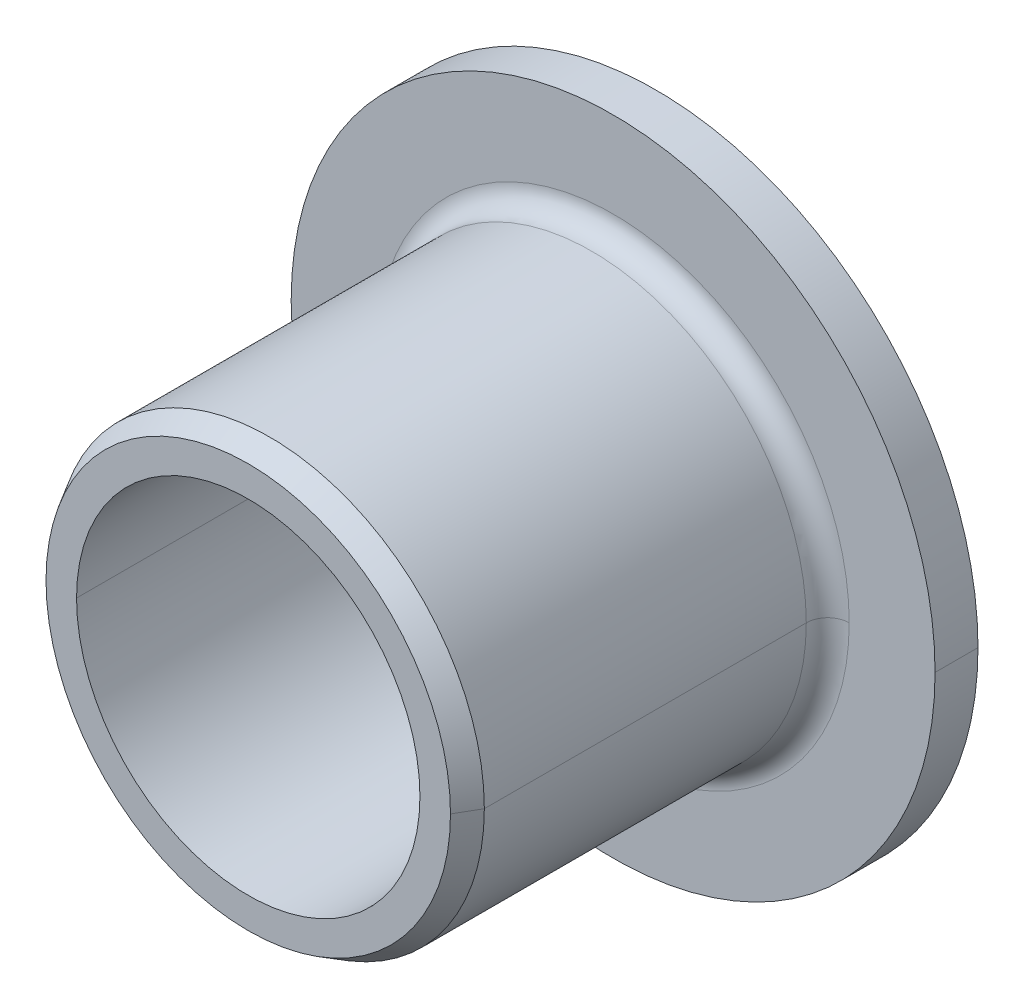
ISO-10303-21;
HEADER;
FILE_DESCRIPTION(('STEP AP214'),'2;1');
FILE_NAME('part.step','',(''),(''),'','','');
FILE_SCHEMA(('AUTOMOTIVE_DESIGN { 1 0 10303 214 1 1 1 1 }'));
ENDSEC;
DATA;
#1=APPLICATION_CONTEXT('core data for automotive mechanical design processes');
#2=APPLICATION_PROTOCOL_DEFINITION('international standard','automotive_design',2000,#1);
#3=PRODUCT_CONTEXT('',#1,'mechanical');
#4=PRODUCT('Part','Part','',(#3));
#5=PRODUCT_RELATED_PRODUCT_CATEGORY('part','',(#4));
#6=PRODUCT_DEFINITION_FORMATION('','',#4);
#7=PRODUCT_DEFINITION_CONTEXT('part definition',#1,'design');
#8=PRODUCT_DEFINITION('design','',#6,#7);
#9=PRODUCT_DEFINITION_SHAPE('','',#8);
#10=(LENGTH_UNIT() NAMED_UNIT(*) SI_UNIT(.MILLI.,.METRE.));
#11=(NAMED_UNIT(*) PLANE_ANGLE_UNIT() SI_UNIT($,.RADIAN.));
#12=(NAMED_UNIT(*) SI_UNIT($,.STERADIAN.) SOLID_ANGLE_UNIT());
#13=UNCERTAINTY_MEASURE_WITH_UNIT(LENGTH_MEASURE(1.E-05),#10,'distance_accuracy_value','');
#14=(GEOMETRIC_REPRESENTATION_CONTEXT(3) GLOBAL_UNCERTAINTY_ASSIGNED_CONTEXT((#13)) GLOBAL_UNIT_ASSIGNED_CONTEXT((#10,
#11,#12)) REPRESENTATION_CONTEXT('',''));
#15=CARTESIAN_POINT('',(0.,0.,0.));
#16=DIRECTION('',(0.,0.,1.));
#17=DIRECTION('',(1.,0.,0.));
#18=AXIS2_PLACEMENT_3D('',#15,#16,#17);
#19=CARTESIAN_POINT('',(5.75,0.,0.));
#20=DIRECTION('',(0.,0.,-1.));
#21=DIRECTION('',(0.,-1.,0.));
#22=AXIS2_PLACEMENT_3D('',#19,#20,#21);
#23=PLANE('',#22);
#24=CARTESIAN_POINT('',(0.,0.,0.));
#25=DIRECTION('',(0.,0.,1.));
#26=DIRECTION('',(1.,0.,0.));
#27=AXIS2_PLACEMENT_3D('',#24,#25,#26);
#28=CIRCLE('',#27,4.);
#29=CARTESIAN_POINT('',(4.,0.,0.));
#30=VERTEX_POINT('',#29);
#31=CARTESIAN_POINT('',(-4.,0.,0.));
#32=VERTEX_POINT('',#31);
#33=EDGE_CURVE('E11',#30,#32,#28,.T.);
#34=ORIENTED_EDGE('',*,*,#33,.T.);
#35=CARTESIAN_POINT('',(0.,0.,0.));
#36=DIRECTION('',(0.,0.,1.));
#37=DIRECTION('',(1.,0.,0.));
#38=AXIS2_PLACEMENT_3D('',#35,#36,#37);
#39=CIRCLE('',#38,4.);
#40=EDGE_CURVE('E145',#32,#30,#39,.T.);
#41=ORIENTED_EDGE('',*,*,#40,.T.);
#42=EDGE_LOOP('',(#34,#41));
#43=FACE_BOUND('',#42,.T.);
#44=CARTESIAN_POINT('',(0.,0.,0.));
#45=DIRECTION('',(0.,0.,1.));
#46=DIRECTION('',(1.,0.,0.));
#47=AXIS2_PLACEMENT_3D('',#44,#45,#46);
#48=CIRCLE('',#47,7.5);
#49=CARTESIAN_POINT('',(7.5,0.,0.));
#50=VERTEX_POINT('',#49);
#51=CARTESIAN_POINT('',(-7.5,0.,0.));
#52=VERTEX_POINT('',#51);
#53=EDGE_CURVE('E153',#50,#52,#48,.T.);
#54=ORIENTED_EDGE('',*,*,#53,.F.);
#55=CARTESIAN_POINT('',(0.,0.,0.));
#56=DIRECTION('',(0.,0.,1.));
#57=DIRECTION('',(1.,0.,0.));
#58=AXIS2_PLACEMENT_3D('',#55,#56,#57);
#59=CIRCLE('',#58,7.5);
#60=EDGE_CURVE('E110',#52,#50,#59,.T.);
#61=ORIENTED_EDGE('',*,*,#60,.F.);
#62=EDGE_LOOP('',(#54,#61));
#63=FACE_BOUND('',#62,.T.);
#64=ADVANCED_FACE('F16',(#43,#63),#23,.T.);
#65=CARTESIAN_POINT('',(0.,0.,4.75));
#66=DIRECTION('',(0.,0.,1.));
#67=DIRECTION('',(1.,0.,0.));
#68=AXIS2_PLACEMENT_3D('',#65,#66,#67);
#69=CYLINDRICAL_SURFACE('',#68,4.);
#70=DIRECTION('',(0.,0.,1.));
#71=VECTOR('',#70,1.);
#72=CARTESIAN_POINT('',(4.,0.,4.75));
#73=LINE('',#72,#71);
#74=CARTESIAN_POINT('',(4.,0.,9.5));
#75=VERTEX_POINT('',#74);
#76=EDGE_CURVE('E150',#30,#75,#73,.T.);
#77=ORIENTED_EDGE('',*,*,#76,.T.);
#78=CARTESIAN_POINT('',(0.,0.,9.5));
#79=DIRECTION('',(0.,0.,1.));
#80=DIRECTION('',(1.,0.,0.));
#81=AXIS2_PLACEMENT_3D('',#78,#79,#80);
#82=CIRCLE('',#81,4.);
#83=CARTESIAN_POINT('',(-4.,0.,9.5));
#84=VERTEX_POINT('',#83);
#85=EDGE_CURVE('E27',#75,#84,#82,.T.);
#86=ORIENTED_EDGE('',*,*,#85,.T.);
#87=DIRECTION('',(0.,0.,-1.));
#88=VECTOR('',#87,1.);
#89=CARTESIAN_POINT('',(-4.,0.,4.75));
#90=LINE('',#89,#88);
#91=EDGE_CURVE('E149',#84,#32,#90,.T.);
#92=ORIENTED_EDGE('',*,*,#91,.T.);
#93=ORIENTED_EDGE('',*,*,#33,.F.);
#94=EDGE_LOOP('',(#77,#86,#92,#93));
#95=FACE_BOUND('',#94,.T.);
#96=ADVANCED_FACE('F210',(#95),#69,.F.);
#97=CARTESIAN_POINT('',(4.3556624327,0.,9.5));
#98=DIRECTION('',(0.,0.,1.));
#99=DIRECTION('',(1.,0.,0.));
#100=AXIS2_PLACEMENT_3D('',#97,#98,#99);
#101=PLANE('',#100);
#102=ORIENTED_EDGE('',*,*,#85,.F.);
#103=CARTESIAN_POINT('',(0.,0.,9.5));
#104=DIRECTION('',(0.,0.,1.));
#105=DIRECTION('',(1.,0.,0.));
#106=AXIS2_PLACEMENT_3D('',#103,#104,#105);
#107=CIRCLE('',#106,4.);
#108=EDGE_CURVE('E159',#84,#75,#107,.T.);
#109=ORIENTED_EDGE('',*,*,#108,.F.);
#110=EDGE_LOOP('',(#102,#109));
#111=FACE_BOUND('',#110,.T.);
#112=CARTESIAN_POINT('',(0.,0.,9.5));
#113=DIRECTION('',(0.,0.,1.));
#114=DIRECTION('',(1.,0.,0.));
#115=AXIS2_PLACEMENT_3D('',#112,#113,#114);
#116=CIRCLE('',#115,4.7113248654);
#117=CARTESIAN_POINT('',(4.7113248654,0.,9.5));
#118=VERTEX_POINT('',#117);
#119=CARTESIAN_POINT('',(-4.7113248654,0.,9.5));
#120=VERTEX_POINT('',#119);
#121=EDGE_CURVE('E158',#118,#120,#116,.T.);
#122=ORIENTED_EDGE('',*,*,#121,.T.);
#123=CARTESIAN_POINT('',(0.,0.,9.5));
#124=DIRECTION('',(0.,0.,1.));
#125=DIRECTION('',(1.,0.,0.));
#126=AXIS2_PLACEMENT_3D('',#123,#124,#125);
#127=CIRCLE('',#126,4.7113248654);
#128=EDGE_CURVE('E141',#120,#118,#127,.T.);
#129=ORIENTED_EDGE('',*,*,#128,.T.);
#130=EDGE_LOOP('',(#122,#129));
#131=FACE_BOUND('',#130,.T.);
#132=ADVANCED_FACE('F18',(#111,#131),#101,.T.);
#133=CARTESIAN_POINT('',(0.,0.,9.25));
#134=DIRECTION('',(0.,0.,-1.));
#135=DIRECTION('',(1.,0.,0.));
#136=AXIS2_PLACEMENT_3D('',#133,#134,#135);
#137=CONICAL_SURFACE('',#136,4.8556624327,0.52359877560608);
#138=DIRECTION('',(-0.500000000006738,0.,0.866025403780548));
#139=VECTOR('',#138,1.);
#140=CARTESIAN_POINT('',(4.8556624327,0.,9.25));
#141=LINE('',#140,#139);
#142=CARTESIAN_POINT('',(5.,0.,9.));
#143=VERTEX_POINT('',#142);
#144=EDGE_CURVE('E163',#143,#118,#141,.T.);
#145=ORIENTED_EDGE('',*,*,#144,.T.);
#146=ORIENTED_EDGE('',*,*,#128,.F.);
#147=DIRECTION('',(-0.500000000006738,0.,-0.866025403780548));
#148=VECTOR('',#147,1.);
#149=CARTESIAN_POINT('',(-4.8556624327,0.,9.25));
#150=LINE('',#149,#148);
#151=CARTESIAN_POINT('',(-5.,0.,9.));
#152=VERTEX_POINT('',#151);
#153=EDGE_CURVE('E154',#120,#152,#150,.T.);
#154=ORIENTED_EDGE('',*,*,#153,.T.);
#155=CARTESIAN_POINT('',(0.,0.,9.));
#156=DIRECTION('',(0.,0.,1.));
#157=DIRECTION('',(1.,0.,0.));
#158=AXIS2_PLACEMENT_3D('',#155,#156,#157);
#159=CIRCLE('',#158,5.);
#160=EDGE_CURVE('E109',#152,#143,#159,.T.);
#161=ORIENTED_EDGE('',*,*,#160,.T.);
#162=EDGE_LOOP('',(#145,#146,#154,#161));
#163=FACE_BOUND('',#162,.T.);
#164=ADVANCED_FACE('F199',(#163),#137,.T.);
#165=CARTESIAN_POINT('',(0.,0.,5.25));
#166=DIRECTION('',(0.,0.,1.));
#167=DIRECTION('',(1.,0.,0.));
#168=AXIS2_PLACEMENT_3D('',#165,#166,#167);
#169=CYLINDRICAL_SURFACE('',#168,5.);
#170=DIRECTION('',(0.,0.,1.));
#171=VECTOR('',#170,1.);
#172=CARTESIAN_POINT('',(5.,0.,5.25));
#173=LINE('',#172,#171);
#174=CARTESIAN_POINT('',(5.,0.,1.5));
#175=VERTEX_POINT('',#174);
#176=EDGE_CURVE('E169',#175,#143,#173,.T.);
#177=ORIENTED_EDGE('',*,*,#176,.T.);
#178=ORIENTED_EDGE('',*,*,#160,.F.);
#179=DIRECTION('',(0.,0.,-1.));
#180=VECTOR('',#179,1.);
#181=CARTESIAN_POINT('',(-5.,0.,5.25));
#182=LINE('',#181,#180);
#183=CARTESIAN_POINT('',(-5.,0.,1.5));
#184=VERTEX_POINT('',#183);
#185=EDGE_CURVE('E121',#152,#184,#182,.T.);
#186=ORIENTED_EDGE('',*,*,#185,.T.);
#187=CARTESIAN_POINT('',(0.,0.,1.5));
#188=DIRECTION('',(0.,0.,1.));
#189=DIRECTION('',(1.,0.,0.));
#190=AXIS2_PLACEMENT_3D('',#187,#188,#189);
#191=CIRCLE('',#190,5.);
#192=EDGE_CURVE('E119',#184,#175,#191,.T.);
#193=ORIENTED_EDGE('',*,*,#192,.T.);
#194=EDGE_LOOP('',(#177,#178,#186,#193));
#195=FACE_BOUND('',#194,.T.);
#196=ADVANCED_FACE('F203',(#195),#169,.T.);
#197=CARTESIAN_POINT('',(0.,0.,1.5));
#198=DIRECTION('',(0.,0.,1.));
#199=DIRECTION('',(1.,0.,0.));
#200=AXIS2_PLACEMENT_3D('',#197,#198,#199);
#201=TOROIDAL_SURFACE('',#200,5.5,0.5);
#202=CARTESIAN_POINT('',(-5.5,0.,1.5));
#203=DIRECTION('',(0.,-1.,0.));
#204=DIRECTION('',(-1.,0.,0.));
#205=AXIS2_PLACEMENT_3D('',#202,#203,#204);
#206=CIRCLE('',#205,0.5);
#207=CARTESIAN_POINT('',(-5.5,0.,1.));
#208=VERTEX_POINT('',#207);
#209=EDGE_CURVE('E102',#208,#184,#206,.T.);
#210=ORIENTED_EDGE('',*,*,#209,.T.);
#211=CARTESIAN_POINT('',(0.,0.,1.5));
#212=DIRECTION('',(0.,0.,1.));
#213=DIRECTION('',(1.,0.,0.));
#214=AXIS2_PLACEMENT_3D('',#211,#212,#213);
#215=CIRCLE('',#214,5.);
#216=EDGE_CURVE('E127',#175,#184,#215,.T.);
#217=ORIENTED_EDGE('',*,*,#216,.F.);
#218=CARTESIAN_POINT('',(5.5,0.,1.5));
#219=DIRECTION('',(0.,-1.,0.));
#220=DIRECTION('',(1.,0.,0.));
#221=AXIS2_PLACEMENT_3D('',#218,#219,#220);
#222=CIRCLE('',#221,0.5);
#223=CARTESIAN_POINT('',(5.5,0.,1.));
#224=VERTEX_POINT('',#223);
#225=EDGE_CURVE('E105',#175,#224,#222,.T.);
#226=ORIENTED_EDGE('',*,*,#225,.T.);
#227=CARTESIAN_POINT('',(0.,0.,1.));
#228=DIRECTION('',(0.,0.,1.));
#229=DIRECTION('',(1.,0.,0.));
#230=AXIS2_PLACEMENT_3D('',#227,#228,#229);
#231=CIRCLE('',#230,5.5);
#232=EDGE_CURVE('E97',#224,#208,#231,.T.);
#233=ORIENTED_EDGE('',*,*,#232,.T.);
#234=EDGE_LOOP('',(#210,#217,#226,#233));
#235=FACE_BOUND('',#234,.T.);
#236=ADVANCED_FACE('F99',(#235),#201,.F.);
#237=CARTESIAN_POINT('',(6.5,0.,1.));
#238=DIRECTION('',(0.,0.,1.));
#239=DIRECTION('',(1.,0.,0.));
#240=AXIS2_PLACEMENT_3D('',#237,#238,#239);
#241=PLANE('',#240);
#242=ORIENTED_EDGE('',*,*,#232,.F.);
#243=CARTESIAN_POINT('',(0.,0.,1.));
#244=DIRECTION('',(0.,0.,1.));
#245=DIRECTION('',(1.,0.,0.));
#246=AXIS2_PLACEMENT_3D('',#243,#244,#245);
#247=CIRCLE('',#246,5.5);
#248=EDGE_CURVE('E112',#208,#224,#247,.T.);
#249=ORIENTED_EDGE('',*,*,#248,.F.);
#250=EDGE_LOOP('',(#242,#249));
#251=FACE_BOUND('',#250,.T.);
#252=CARTESIAN_POINT('',(0.,0.,1.));
#253=DIRECTION('',(0.,0.,1.));
#254=DIRECTION('',(1.,0.,0.));
#255=AXIS2_PLACEMENT_3D('',#252,#253,#254);
#256=CIRCLE('',#255,7.5);
#257=CARTESIAN_POINT('',(7.5,0.,1.));
#258=VERTEX_POINT('',#257);
#259=CARTESIAN_POINT('',(-7.5,0.,1.));
#260=VERTEX_POINT('',#259);
#261=EDGE_CURVE('E134',#258,#260,#256,.T.);
#262=ORIENTED_EDGE('',*,*,#261,.T.);
#263=CARTESIAN_POINT('',(0.,0.,1.));
#264=DIRECTION('',(0.,0.,1.));
#265=DIRECTION('',(1.,0.,0.));
#266=AXIS2_PLACEMENT_3D('',#263,#264,#265);
#267=CIRCLE('',#266,7.5);
#268=EDGE_CURVE('E39',#260,#258,#267,.T.);
#269=ORIENTED_EDGE('',*,*,#268,.T.);
#270=EDGE_LOOP('',(#262,#269));
#271=FACE_BOUND('',#270,.T.);
#272=ADVANCED_FACE('F113',(#251,#271),#241,.T.);
#273=CARTESIAN_POINT('',(0.,0.,0.5));
#274=DIRECTION('',(0.,0.,1.));
#275=DIRECTION('',(1.,0.,0.));
#276=AXIS2_PLACEMENT_3D('',#273,#274,#275);
#277=CYLINDRICAL_SURFACE('',#276,7.5);
#278=DIRECTION('',(0.,0.,1.));
#279=VECTOR('',#278,1.);
#280=CARTESIAN_POINT('',(7.5,0.,0.5));
#281=LINE('',#280,#279);
#282=EDGE_CURVE('E144',#50,#258,#281,.T.);
#283=ORIENTED_EDGE('',*,*,#282,.T.);
#284=ORIENTED_EDGE('',*,*,#268,.F.);
#285=DIRECTION('',(0.,0.,-1.));
#286=VECTOR('',#285,1.);
#287=CARTESIAN_POINT('',(-7.5,0.,0.5));
#288=LINE('',#287,#286);
#289=EDGE_CURVE('E20',#260,#52,#288,.T.);
#290=ORIENTED_EDGE('',*,*,#289,.T.);
#291=ORIENTED_EDGE('',*,*,#60,.T.);
#292=EDGE_LOOP('',(#283,#284,#290,#291));
#293=FACE_BOUND('',#292,.T.);
#294=ADVANCED_FACE('F230',(#293),#277,.T.);
#295=CARTESIAN_POINT('',(0.,0.,0.5));
#296=DIRECTION('',(0.,0.,1.));
#297=DIRECTION('',(1.,0.,0.));
#298=AXIS2_PLACEMENT_3D('',#295,#296,#297);
#299=CYLINDRICAL_SURFACE('',#298,7.5);
#300=ORIENTED_EDGE('',*,*,#282,.F.);
#301=ORIENTED_EDGE('',*,*,#53,.T.);
#302=ORIENTED_EDGE('',*,*,#289,.F.);
#303=ORIENTED_EDGE('',*,*,#261,.F.);
#304=EDGE_LOOP('',(#300,#301,#302,#303));
#305=FACE_BOUND('',#304,.T.);
#306=ADVANCED_FACE('F232',(#305),#299,.T.);
#307=CARTESIAN_POINT('',(0.,0.,1.5));
#308=DIRECTION('',(0.,0.,1.));
#309=DIRECTION('',(1.,0.,0.));
#310=AXIS2_PLACEMENT_3D('',#307,#308,#309);
#311=TOROIDAL_SURFACE('',#310,5.5,0.5);
#312=ORIENTED_EDGE('',*,*,#209,.F.);
#313=ORIENTED_EDGE('',*,*,#248,.T.);
#314=ORIENTED_EDGE('',*,*,#225,.F.);
#315=ORIENTED_EDGE('',*,*,#192,.F.);
#316=EDGE_LOOP('',(#312,#313,#314,#315));
#317=FACE_BOUND('',#316,.T.);
#318=ADVANCED_FACE('F118',(#317),#311,.F.);
#319=CARTESIAN_POINT('',(0.,0.,5.25));
#320=DIRECTION('',(0.,0.,1.));
#321=DIRECTION('',(1.,0.,0.));
#322=AXIS2_PLACEMENT_3D('',#319,#320,#321);
#323=CYLINDRICAL_SURFACE('',#322,5.);
#324=ORIENTED_EDGE('',*,*,#176,.F.);
#325=ORIENTED_EDGE('',*,*,#216,.T.);
#326=ORIENTED_EDGE('',*,*,#185,.F.);
#327=CARTESIAN_POINT('',(0.,0.,9.));
#328=DIRECTION('',(0.,0.,1.));
#329=DIRECTION('',(1.,0.,0.));
#330=AXIS2_PLACEMENT_3D('',#327,#328,#329);
#331=CIRCLE('',#330,5.);
#332=EDGE_CURVE('E131',#143,#152,#331,.T.);
#333=ORIENTED_EDGE('',*,*,#332,.F.);
#334=EDGE_LOOP('',(#324,#325,#326,#333));
#335=FACE_BOUND('',#334,.T.);
#336=ADVANCED_FACE('F204',(#335),#323,.T.);
#337=CARTESIAN_POINT('',(0.,0.,9.25));
#338=DIRECTION('',(0.,0.,-1.));
#339=DIRECTION('',(1.,0.,0.));
#340=AXIS2_PLACEMENT_3D('',#337,#338,#339);
#341=CONICAL_SURFACE('',#340,4.8556624327,0.52359877560608);
#342=ORIENTED_EDGE('',*,*,#144,.F.);
#343=ORIENTED_EDGE('',*,*,#332,.T.);
#344=ORIENTED_EDGE('',*,*,#153,.F.);
#345=ORIENTED_EDGE('',*,*,#121,.F.);
#346=EDGE_LOOP('',(#342,#343,#344,#345));
#347=FACE_BOUND('',#346,.T.);
#348=ADVANCED_FACE('F207',(#347),#341,.T.);
#349=CARTESIAN_POINT('',(0.,0.,4.75));
#350=DIRECTION('',(0.,0.,1.));
#351=DIRECTION('',(1.,0.,0.));
#352=AXIS2_PLACEMENT_3D('',#349,#350,#351);
#353=CYLINDRICAL_SURFACE('',#352,4.);
#354=ORIENTED_EDGE('',*,*,#76,.F.);
#355=ORIENTED_EDGE('',*,*,#40,.F.);
#356=ORIENTED_EDGE('',*,*,#91,.F.);
#357=ORIENTED_EDGE('',*,*,#108,.T.);
#358=EDGE_LOOP('',(#354,#355,#356,#357));
#359=FACE_BOUND('',#358,.T.);
#360=ADVANCED_FACE('F238',(#359),#353,.F.);
#361=CLOSED_SHELL('',(#64,#96,#132,#164,#196,#236,#272,#294,#306,#318,#336,#348,#360));
#362=MANIFOLD_SOLID_BREP('B1',#361);
#363=ADVANCED_BREP_SHAPE_REPRESENTATION('',(#18,#362),#14);
#364=SHAPE_DEFINITION_REPRESENTATION(#9,#363);
ENDSEC;
END-ISO-10303-21;
